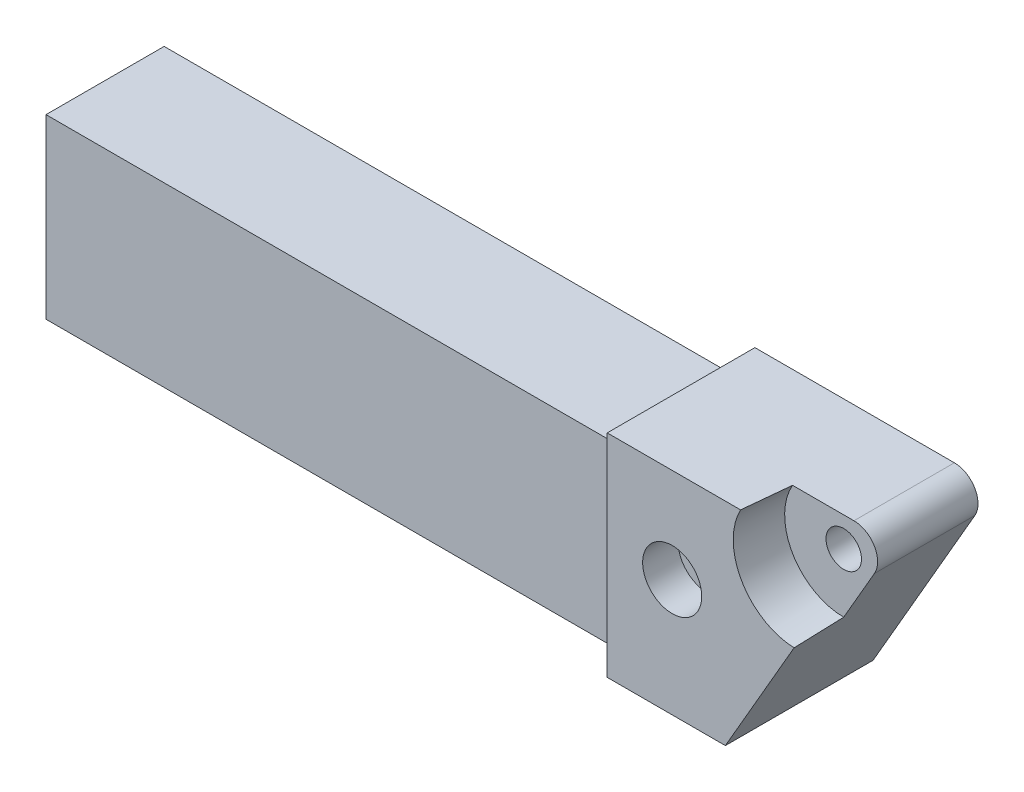
ISO-10303-21;
HEADER;
FILE_DESCRIPTION(('STEP AP214'),'2;1');
FILE_NAME('part.step','',(''),(''),'','','');
FILE_SCHEMA(('AUTOMOTIVE_DESIGN { 1 0 10303 214 1 1 1 1 }'));
ENDSEC;
DATA;
#1=APPLICATION_CONTEXT('core data for automotive mechanical design processes');
#2=APPLICATION_PROTOCOL_DEFINITION('international standard','automotive_design',2000,#1);
#3=PRODUCT_CONTEXT('',#1,'mechanical');
#4=PRODUCT('Part','Part','',(#3));
#5=PRODUCT_RELATED_PRODUCT_CATEGORY('part','',(#4));
#6=PRODUCT_DEFINITION_FORMATION('','',#4);
#7=PRODUCT_DEFINITION_CONTEXT('part definition',#1,'design');
#8=PRODUCT_DEFINITION('design','',#6,#7);
#9=PRODUCT_DEFINITION_SHAPE('','',#8);
#10=(LENGTH_UNIT() NAMED_UNIT(*) SI_UNIT(.MILLI.,.METRE.));
#11=(NAMED_UNIT(*) PLANE_ANGLE_UNIT() SI_UNIT($,.RADIAN.));
#12=(NAMED_UNIT(*) SI_UNIT($,.STERADIAN.) SOLID_ANGLE_UNIT());
#13=UNCERTAINTY_MEASURE_WITH_UNIT(LENGTH_MEASURE(1.E-05),#10,'distance_accuracy_value','');
#14=(GEOMETRIC_REPRESENTATION_CONTEXT(3) GLOBAL_UNCERTAINTY_ASSIGNED_CONTEXT((#13)) GLOBAL_UNIT_ASSIGNED_CONTEXT((#10,
#11,#12)) REPRESENTATION_CONTEXT('',''));
#15=CARTESIAN_POINT('',(0.,0.,0.));
#16=DIRECTION('',(0.,0.,1.));
#17=DIRECTION('',(1.,0.,0.));
#18=AXIS2_PLACEMENT_3D('',#15,#16,#17);
#19=CARTESIAN_POINT('',(-50.,15.,20.));
#20=DIRECTION('',(0.,-1.,0.));
#21=DIRECTION('',(0.,0.,-1.));
#22=AXIS2_PLACEMENT_3D('',#19,#20,#21);
#23=PLANE('',#22);
#24=DIRECTION('',(-1.,0.,0.));
#25=VECTOR('',#24,1.);
#26=CARTESIAN_POINT('',(-50.,15.,20.));
#27=LINE('',#26,#25);
#28=CARTESIAN_POINT('',(45.,15.,20.));
#29=VERTEX_POINT('',#28);
#30=CARTESIAN_POINT('',(-50.,15.,20.));
#31=VERTEX_POINT('',#30);
#32=EDGE_CURVE('E247',#29,#31,#27,.T.);
#33=ORIENTED_EDGE('',*,*,#32,.F.);
#34=DIRECTION('',(0.,0.,-1.));
#35=VECTOR('',#34,1.);
#36=CARTESIAN_POINT('',(45.,15.,20.));
#37=LINE('',#36,#35);
#38=CARTESIAN_POINT('',(45.,15.,0.));
#39=VERTEX_POINT('',#38);
#40=EDGE_CURVE('E263',#29,#39,#37,.T.);
#41=ORIENTED_EDGE('',*,*,#40,.T.);
#42=DIRECTION('',(-1.,0.,0.));
#43=VECTOR('',#42,1.);
#44=CARTESIAN_POINT('',(-50.,15.,0.));
#45=LINE('',#44,#43);
#46=CARTESIAN_POINT('',(-50.,15.,0.));
#47=VERTEX_POINT('',#46);
#48=EDGE_CURVE('E255',#39,#47,#45,.T.);
#49=ORIENTED_EDGE('',*,*,#48,.T.);
#50=DIRECTION('',(0.,0.,-1.));
#51=VECTOR('',#50,1.);
#52=CARTESIAN_POINT('',(-50.,15.,20.));
#53=LINE('',#52,#51);
#54=EDGE_CURVE('E260',#31,#47,#53,.T.);
#55=ORIENTED_EDGE('',*,*,#54,.F.);
#56=EDGE_LOOP('',(#33,#41,#49,#55));
#57=FACE_BOUND('',#56,.T.);
#58=ADVANCED_FACE('F36',(#57),#23,.F.);
#59=CARTESIAN_POINT('',(-50.,15.,20.));
#60=DIRECTION('',(1.,0.,0.));
#61=DIRECTION('',(0.,1.,0.));
#62=AXIS2_PLACEMENT_3D('',#59,#60,#61);
#63=PLANE('',#62);
#64=DIRECTION('',(0.,-1.,0.));
#65=VECTOR('',#64,1.);
#66=CARTESIAN_POINT('',(-50.,15.,0.));
#67=LINE('',#66,#65);
#68=CARTESIAN_POINT('',(-50.,-15.,0.));
#69=VERTEX_POINT('',#68);
#70=EDGE_CURVE('E253',#47,#69,#67,.T.);
#71=ORIENTED_EDGE('',*,*,#70,.T.);
#72=DIRECTION('',(0.,0.,-1.));
#73=VECTOR('',#72,1.);
#74=CARTESIAN_POINT('',(-50.,-15.,20.));
#75=LINE('',#74,#73);
#76=CARTESIAN_POINT('',(-50.,-15.,20.));
#77=VERTEX_POINT('',#76);
#78=EDGE_CURVE('E257',#77,#69,#75,.T.);
#79=ORIENTED_EDGE('',*,*,#78,.F.);
#80=DIRECTION('',(0.,-1.,0.));
#81=VECTOR('',#80,1.);
#82=CARTESIAN_POINT('',(-50.,15.,20.));
#83=LINE('',#82,#81);
#84=EDGE_CURVE('E249',#31,#77,#83,.T.);
#85=ORIENTED_EDGE('',*,*,#84,.F.);
#86=ORIENTED_EDGE('',*,*,#54,.T.);
#87=EDGE_LOOP('',(#71,#79,#85,#86));
#88=FACE_BOUND('',#87,.T.);
#89=ADVANCED_FACE('F167',(#88),#63,.F.);
#90=CARTESIAN_POINT('',(-50.,-15.,20.));
#91=DIRECTION('',(0.,1.,0.));
#92=DIRECTION('',(0.,0.,1.));
#93=AXIS2_PLACEMENT_3D('',#90,#91,#92);
#94=PLANE('',#93);
#95=DIRECTION('',(1.,0.,0.));
#96=VECTOR('',#95,1.);
#97=CARTESIAN_POINT('',(-50.,-15.,0.));
#98=LINE('',#97,#96);
#99=CARTESIAN_POINT('',(70.,-15.,0.));
#100=VERTEX_POINT('',#99);
#101=EDGE_CURVE('E250',#69,#100,#98,.T.);
#102=ORIENTED_EDGE('',*,*,#101,.T.);
#103=DIRECTION('',(0.,0.,1.));
#104=VECTOR('',#103,1.);
#105=CARTESIAN_POINT('',(70.,-15.,0.));
#106=LINE('',#105,#104);
#107=CARTESIAN_POINT('',(70.,-15.,25.));
#108=VERTEX_POINT('',#107);
#109=EDGE_CURVE('E204',#100,#108,#106,.T.);
#110=ORIENTED_EDGE('',*,*,#109,.T.);
#111=DIRECTION('',(1.,0.,0.));
#112=VECTOR('',#111,1.);
#113=CARTESIAN_POINT('',(50.,-15.,25.));
#114=LINE('',#113,#112);
#115=CARTESIAN_POINT('',(50.,-15.,25.));
#116=VERTEX_POINT('',#115);
#117=EDGE_CURVE('E232',#116,#108,#114,.T.);
#118=ORIENTED_EDGE('',*,*,#117,.F.);
#119=CARTESIAN_POINT('',(45.,-15.,25.));
#120=DIRECTION('',(0.,1.,0.));
#121=DIRECTION('',(0.,0.,1.));
#122=AXIS2_PLACEMENT_3D('',#119,#120,#121);
#123=CIRCLE('',#122,5.);
#124=CARTESIAN_POINT('',(45.,-15.,20.));
#125=VERTEX_POINT('',#124);
#126=EDGE_CURVE('E217',#116,#125,#123,.T.);
#127=ORIENTED_EDGE('',*,*,#126,.T.);
#128=DIRECTION('',(1.,0.,0.));
#129=VECTOR('',#128,1.);
#130=CARTESIAN_POINT('',(-50.,-15.,20.));
#131=LINE('',#130,#129);
#132=EDGE_CURVE('E252',#77,#125,#131,.T.);
#133=ORIENTED_EDGE('',*,*,#132,.F.);
#134=ORIENTED_EDGE('',*,*,#78,.T.);
#135=EDGE_LOOP('',(#102,#110,#118,#127,#133,#134));
#136=FACE_BOUND('',#135,.T.);
#137=ADVANCED_FACE('F171',(#136),#94,.F.);
#138=CARTESIAN_POINT('',(0.,0.,20.));
#139=DIRECTION('',(0.,0.,1.));
#140=DIRECTION('',(1.,0.,0.));
#141=AXIS2_PLACEMENT_3D('',#138,#139,#140);
#142=PLANE('',#141);
#143=ORIENTED_EDGE('',*,*,#132,.T.);
#144=DIRECTION('',(0.,1.,0.));
#145=VECTOR('',#144,1.);
#146=CARTESIAN_POINT('',(45.,15.,20.));
#147=LINE('',#146,#145);
#148=EDGE_CURVE('E224',#125,#29,#147,.T.);
#149=ORIENTED_EDGE('',*,*,#148,.T.);
#150=ORIENTED_EDGE('',*,*,#32,.T.);
#151=ORIENTED_EDGE('',*,*,#84,.T.);
#152=EDGE_LOOP('',(#143,#149,#150,#151));
#153=FACE_BOUND('',#152,.T.);
#154=ADVANCED_FACE('F175',(#153),#142,.T.);
#155=CARTESIAN_POINT('',(0.,0.,0.));
#156=DIRECTION('',(0.,0.,1.));
#157=DIRECTION('',(1.,0.,0.));
#158=AXIS2_PLACEMENT_3D('',#155,#156,#157);
#159=PLANE('',#158);
#160=CARTESIAN_POINT('',(61.,4.84504138230249,0.));
#161=DIRECTION('',(0.,0.,1.));
#162=DIRECTION('',(1.,0.,0.));
#163=AXIS2_PLACEMENT_3D('',#160,#161,#162);
#164=CIRCLE('',#163,2.50000000000002);
#165=CARTESIAN_POINT('',(63.5,4.84504138230249,0.));
#166=VERTEX_POINT('',#165);
#167=EDGE_CURVE('E292',#166,#166,#164,.T.);
#168=ORIENTED_EDGE('',*,*,#167,.T.);
#169=EDGE_LOOP('',(#168));
#170=FACE_BOUND('',#169,.T.);
#171=CARTESIAN_POINT('',(82.0348902533414,15.8450413823025,0.));
#172=DIRECTION('',(0.,0.,1.));
#173=DIRECTION('',(1.,0.,0.));
#174=AXIS2_PLACEMENT_3D('',#171,#172,#173);
#175=CIRCLE('',#174,3.00000000000001);
#176=CARTESIAN_POINT('',(85.0348902533414,15.8450413823025,0.));
#177=VERTEX_POINT('',#176);
#178=EDGE_CURVE('E129',#177,#177,#175,.T.);
#179=ORIENTED_EDGE('',*,*,#178,.T.);
#180=EDGE_LOOP('',(#179));
#181=FACE_BOUND('',#180,.T.);
#182=DIRECTION('',(-1.,0.,0.));
#183=VECTOR('',#182,1.);
#184=CARTESIAN_POINT('',(90.6951442911858,20.8450413823025,0.));
#185=LINE('',#184,#183);
#186=CARTESIAN_POINT('',(83.7669410609103,20.8450413823025,0.));
#187=VERTEX_POINT('',#186);
#188=CARTESIAN_POINT('',(50.,20.8450413823025,0.));
#189=VERTEX_POINT('',#188);
#190=EDGE_CURVE('E207',#187,#189,#185,.T.);
#191=ORIENTED_EDGE('',*,*,#190,.F.);
#192=CARTESIAN_POINT('',(83.7669410609103,16.8450413823025,0.));
#193=DIRECTION('',(0.,0.,1.));
#194=DIRECTION('',(1.,0.,0.));
#195=AXIS2_PLACEMENT_3D('',#192,#193,#194);
#196=CIRCLE('',#195,4.);
#197=CARTESIAN_POINT('',(87.231042676048,14.8450413823025,0.));
#198=VERTEX_POINT('',#197);
#199=EDGE_CURVE('E11',#187,#198,#196,.F.);
#200=ORIENTED_EDGE('',*,*,#199,.T.);
#201=DIRECTION('',(0.500000000000004,0.866025403784436,0.));
#202=VECTOR('',#201,1.);
#203=CARTESIAN_POINT('',(70.,-15.,0.));
#204=LINE('',#203,#202);
#205=EDGE_CURVE('E200',#100,#198,#204,.T.);
#206=ORIENTED_EDGE('',*,*,#205,.F.);
#207=ORIENTED_EDGE('',*,*,#101,.F.);
#208=ORIENTED_EDGE('',*,*,#70,.F.);
#209=ORIENTED_EDGE('',*,*,#48,.F.);
#210=CARTESIAN_POINT('',(45.,20.,0.));
#211=DIRECTION('',(0.,0.,1.));
#212=DIRECTION('',(1.,0.,0.));
#213=AXIS2_PLACEMENT_3D('',#210,#211,#212);
#214=CIRCLE('',#213,5.);
#215=CARTESIAN_POINT('',(50.,20.,0.));
#216=VERTEX_POINT('',#215);
#217=EDGE_CURVE('E218',#39,#216,#214,.T.);
#218=ORIENTED_EDGE('',*,*,#217,.T.);
#219=DIRECTION('',(0.,-1.,0.));
#220=VECTOR('',#219,1.);
#221=CARTESIAN_POINT('',(50.,20.8450413823025,0.));
#222=LINE('',#221,#220);
#223=EDGE_CURVE('E208',#189,#216,#222,.T.);
#224=ORIENTED_EDGE('',*,*,#223,.F.);
#225=EDGE_LOOP('',(#191,#200,#206,#207,#208,#209,#218,#224));
#226=FACE_BOUND('',#225,.T.);
#227=ADVANCED_FACE('F177',(#170,#181,#226),#159,.F.);
#228=CARTESIAN_POINT('',(50.,20.8450413823025,0.));
#229=DIRECTION('',(-1.,0.,0.));
#230=DIRECTION('',(0.,0.,1.));
#231=AXIS2_PLACEMENT_3D('',#228,#229,#230);
#232=PLANE('',#231);
#233=ORIENTED_EDGE('',*,*,#223,.T.);
#234=DIRECTION('',(0.,0.,-1.));
#235=VECTOR('',#234,1.);
#236=CARTESIAN_POINT('',(50.,20.,0.));
#237=LINE('',#236,#235);
#238=CARTESIAN_POINT('',(50.,20.,25.));
#239=VERTEX_POINT('',#238);
#240=EDGE_CURVE('E273',#216,#239,#237,.F.);
#241=ORIENTED_EDGE('',*,*,#240,.T.);
#242=DIRECTION('',(0.,-1.,0.));
#243=VECTOR('',#242,1.);
#244=CARTESIAN_POINT('',(50.,20.8450413823025,25.));
#245=LINE('',#244,#243);
#246=CARTESIAN_POINT('',(50.,20.8450413823025,25.));
#247=VERTEX_POINT('',#246);
#248=EDGE_CURVE('E235',#247,#239,#245,.T.);
#249=ORIENTED_EDGE('',*,*,#248,.F.);
#250=DIRECTION('',(0.,0.,1.));
#251=VECTOR('',#250,1.);
#252=CARTESIAN_POINT('',(50.,20.8450413823025,0.));
#253=LINE('',#252,#251);
#254=EDGE_CURVE('E270',#189,#247,#253,.T.);
#255=ORIENTED_EDGE('',*,*,#254,.F.);
#256=EDGE_LOOP('',(#233,#241,#249,#255));
#257=FACE_BOUND('',#256,.T.);
#258=ADVANCED_FACE('F180',(#257),#232,.T.);
#259=CARTESIAN_POINT('',(90.6951442911858,20.8450413823025,0.));
#260=DIRECTION('',(0.,1.,0.));
#261=DIRECTION('',(-1.,0.,0.));
#262=AXIS2_PLACEMENT_3D('',#259,#260,#261);
#263=PLANE('',#262);
#264=DIRECTION('',(1.,0.,0.));
#265=VECTOR('',#264,1.);
#266=CARTESIAN_POINT('',(90.6951442911858,20.8450413823025,17.));
#267=LINE('',#266,#265);
#268=CARTESIAN_POINT('',(73.3746362154971,20.8450413823025,17.));
#269=VERTEX_POINT('',#268);
#270=CARTESIAN_POINT('',(83.7669410609103,20.8450413823025,17.));
#271=VERTEX_POINT('',#270);
#272=EDGE_CURVE('E115',#269,#271,#267,.T.);
#273=ORIENTED_EDGE('',*,*,#272,.T.);
#274=DIRECTION('',(0.,0.,1.));
#275=VECTOR('',#274,1.);
#276=CARTESIAN_POINT('',(83.7669410609103,20.8450413823025,0.));
#277=LINE('',#276,#275);
#278=EDGE_CURVE('E44',#271,#187,#277,.F.);
#279=ORIENTED_EDGE('',*,*,#278,.T.);
#280=ORIENTED_EDGE('',*,*,#190,.T.);
#281=ORIENTED_EDGE('',*,*,#254,.T.);
#282=DIRECTION('',(-1.,0.,0.));
#283=VECTOR('',#282,1.);
#284=CARTESIAN_POINT('',(90.6951442911858,20.8450413823025,25.));
#285=LINE('',#284,#283);
#286=CARTESIAN_POINT('',(72.5750774008658,20.8450413823025,25.));
#287=VERTEX_POINT('',#286);
#288=EDGE_CURVE('E134',#287,#247,#285,.T.);
#289=ORIENTED_EDGE('',*,*,#288,.F.);
#290=CARTESIAN_POINT('',(73.3746362154971,20.8450413823025,17.));
#291=CARTESIAN_POINT('',(73.2205556846486,20.8450413823025,18.5252956211243));
#292=CARTESIAN_POINT('',(73.0674733243553,20.8450413823025,20.0506917554421));
#293=CARTESIAN_POINT('',(72.7630573666214,20.8450413823025,23.1016570178582));
#294=CARTESIAN_POINT('',(72.6117237674327,20.8450413823025,24.627226145782));
#295=CARTESIAN_POINT('',(72.3105574794071,20.8450413823025,27.6785120799178));
#296=CARTESIAN_POINT('',(72.1607247902429,20.8450413823025,29.2042288860975));
#297=CARTESIAN_POINT('',(71.8623765659033,20.8450413823025,32.2557928396095));
#298=CARTESIAN_POINT('',(71.7138610320428,20.8450413823025,33.7816399870703));
#299=CARTESIAN_POINT('',(71.5659123636992,20.8450413823025,35.307541947163));
#300=B_SPLINE_CURVE_WITH_KNOTS('',3,(#290,#291,#292,#293,#294,#295,#296,#297,#298,#299),
.UNSPECIFIED.,.F.,.F.,(4,2,2,2,4),(0.,4.5991739108353,9.19834322375983,13.7975115335998,
18.396684434636),.UNSPECIFIED.);
#301=EDGE_CURVE('E121',#269,#287,#300,.T.);
#302=ORIENTED_EDGE('',*,*,#301,.F.);
#303=EDGE_LOOP('',(#273,#279,#280,#281,#289,#302));
#304=FACE_BOUND('',#303,.T.);
#305=ADVANCED_FACE('F132',(#304),#263,.T.);
#306=CARTESIAN_POINT('',(70.,-15.,0.));
#307=DIRECTION('',(0.866025403784436,-0.500000000000004,0.));
#308=DIRECTION('',(0.500000000000004,0.866025403784437,0.));
#309=AXIS2_PLACEMENT_3D('',#306,#307,#308);
#310=PLANE('',#309);
#311=ORIENTED_EDGE('',*,*,#205,.T.);
#312=DIRECTION('',(0.,0.,1.));
#313=VECTOR('',#312,1.);
#314=CARTESIAN_POINT('',(87.231042676048,14.8450413823025,0.));
#315=LINE('',#314,#313);
#316=CARTESIAN_POINT('',(87.231042676048,14.8450413823025,17.));
#317=VERTEX_POINT('',#316);
#318=EDGE_CURVE('E202',#198,#317,#315,.T.);
#319=ORIENTED_EDGE('',*,*,#318,.T.);
#320=DIRECTION('',(-0.500000000000004,-0.866025403784437,0.));
#321=VECTOR('',#320,1.);
#322=CARTESIAN_POINT('',(70.,-15.,17.));
#323=LINE('',#322,#321);
#324=CARTESIAN_POINT('',(82.0348902533413,5.8450413823025,17.));
#325=VERTEX_POINT('',#324);
#326=EDGE_CURVE('E212',#317,#325,#323,.T.);
#327=ORIENTED_EDGE('',*,*,#326,.T.);
#328=CARTESIAN_POINT('',(80.2114300170842,2.68671560752352,54.5371041974489));
#329=CARTESIAN_POINT('',(80.2852990569576,2.81466053769065,52.9726505439011));
#330=CARTESIAN_POINT('',(80.3593530022565,2.94292573344932,51.408231805601));
#331=CARTESIAN_POINT('',(80.5078785318212,3.20017949687644,48.2794734881091));
#332=CARTESIAN_POINT('',(80.5823501161274,3.32916806461481,46.715133908925));
#333=CARTESIAN_POINT('',(80.8064626597205,3.71734237673168,42.0222564929249));
#334=CARTESIAN_POINT('',(80.9568017933977,3.97773739462647,38.8938518404164));
#335=CARTESIAN_POINT('',(81.2598540890713,4.50263936808348,32.6374983976965));
#336=CARTESIAN_POINT('',(81.4125672535119,4.76714632787923,29.5095496079577));
#337=CARTESIAN_POINT('',(81.6439795759656,5.16796422786652,24.818084591633));
#338=CARTESIAN_POINT('',(81.7215075454927,5.30224661009516,23.2543373059183));
#339=CARTESIAN_POINT('',(81.8774787986248,5.57239674504016,20.1270248040092));
#340=CARTESIAN_POINT('',(81.9559220825686,5.70826449834342,18.5634595878825));
#341=CARTESIAN_POINT('',(82.0348902533413,5.84504138230251,17.));
#342=B_SPLINE_CURVE_WITH_KNOTS('',3,(#328,#329,#330,#331,#332,#333,#334,#335,#336,#337,#338,
#339,#340,#341),.UNSPECIFIED.,.F.,.F.,(4,2,2,2,2,2,4),(0.,4.71424176629178,9.42848398824529,
18.8569439121076,28.285413543874,32.9996602695487,37.7139087404478),.UNSPECIFIED.);
#343=CARTESIAN_POINT('',(81.6351108460257,5.15260313701207,25.));
#344=VERTEX_POINT('',#343);
#345=EDGE_CURVE('E128',#344,#325,#342,.T.);
#346=ORIENTED_EDGE('',*,*,#345,.F.);
#347=DIRECTION('',(0.500000000000004,0.866025403784436,0.));
#348=VECTOR('',#347,1.);
#349=CARTESIAN_POINT('',(70.,-15.,25.));
#350=LINE('',#349,#348);
#351=EDGE_CURVE('E230',#108,#344,#350,.T.);
#352=ORIENTED_EDGE('',*,*,#351,.F.);
#353=ORIENTED_EDGE('',*,*,#109,.F.);
#354=EDGE_LOOP('',(#311,#319,#327,#346,#352,#353));
#355=FACE_BOUND('',#354,.T.);
#356=ADVANCED_FACE('F187',(#355),#310,.T.);
#357=CARTESIAN_POINT('',(0.,0.,25.));
#358=DIRECTION('',(0.,0.,1.));
#359=DIRECTION('',(1.,0.,0.));
#360=AXIS2_PLACEMENT_3D('',#357,#358,#359);
#361=PLANE('',#360);
#362=CARTESIAN_POINT('',(61.,4.84504138230249,25.));
#363=DIRECTION('',(0.,0.,1.));
#364=DIRECTION('',(1.,0.,0.));
#365=AXIS2_PLACEMENT_3D('',#362,#363,#364);
#366=CIRCLE('',#365,5.00000000000002);
#367=CARTESIAN_POINT('',(66.,4.84504138230249,25.));
#368=VERTEX_POINT('',#367);
#369=EDGE_CURVE('E303',#368,#368,#366,.T.);
#370=ORIENTED_EDGE('',*,*,#369,.F.);
#371=EDGE_LOOP('',(#370));
#372=FACE_BOUND('',#371,.T.);
#373=CARTESIAN_POINT('',(82.0348902533414,15.8450413823025,25.));
#374=DIRECTION('',(0.,0.,1.));
#375=DIRECTION('',(1.,0.,0.));
#376=AXIS2_PLACEMENT_3D('',#373,#374,#375);
#377=CIRCLE('',#376,10.6999093082074);
#378=EDGE_CURVE('E215',#287,#344,#377,.T.);
#379=ORIENTED_EDGE('',*,*,#378,.F.);
#380=ORIENTED_EDGE('',*,*,#288,.T.);
#381=ORIENTED_EDGE('',*,*,#248,.T.);
#382=EDGE_CURVE('E229',#239,#116,#245,.T.);
#383=ORIENTED_EDGE('',*,*,#382,.T.);
#384=ORIENTED_EDGE('',*,*,#117,.T.);
#385=ORIENTED_EDGE('',*,*,#351,.T.);
#386=EDGE_LOOP('',(#379,#380,#381,#383,#384,#385));
#387=FACE_BOUND('',#386,.T.);
#388=ADVANCED_FACE('F160',(#372,#387),#361,.T.);
#389=CARTESIAN_POINT('',(45.,0.,25.));
#390=DIRECTION('',(0.,-1.,0.));
#391=DIRECTION('',(0.,0.,-1.));
#392=AXIS2_PLACEMENT_3D('',#389,#390,#391);
#393=CYLINDRICAL_SURFACE('',#392,5.);
#394=ORIENTED_EDGE('',*,*,#126,.F.);
#395=ORIENTED_EDGE('',*,*,#382,.F.);
#396=CARTESIAN_POINT('',(45.,20.,25.));
#397=DIRECTION('',(0.,-0.707106781186547,0.707106781186547));
#398=DIRECTION('',(0.,-0.707106781186547,-0.707106781186547));
#399=AXIS2_PLACEMENT_3D('',#396,#397,#398);
#400=ELLIPSE('',#399,7.07106781186547,5.);
#401=EDGE_CURVE('E120',#29,#239,#400,.T.);
#402=ORIENTED_EDGE('',*,*,#401,.F.);
#403=ORIENTED_EDGE('',*,*,#148,.F.);
#404=EDGE_LOOP('',(#394,#395,#402,#403));
#405=FACE_BOUND('',#404,.T.);
#406=ADVANCED_FACE('F156',(#405),#393,.F.);
#407=CARTESIAN_POINT('',(45.,20.,20.));
#408=DIRECTION('',(0.,0.,-1.));
#409=DIRECTION('',(-1.,0.,0.));
#410=AXIS2_PLACEMENT_3D('',#407,#408,#409);
#411=CYLINDRICAL_SURFACE('',#410,5.);
#412=ORIENTED_EDGE('',*,*,#401,.T.);
#413=ORIENTED_EDGE('',*,*,#240,.F.);
#414=ORIENTED_EDGE('',*,*,#217,.F.);
#415=ORIENTED_EDGE('',*,*,#40,.F.);
#416=EDGE_LOOP('',(#412,#413,#414,#415));
#417=FACE_BOUND('',#416,.T.);
#418=ADVANCED_FACE('F155',(#417),#411,.F.);
#419=CARTESIAN_POINT('',(82.0348902533414,15.8450413823025,17.));
#420=DIRECTION('',(0.,0.,1.));
#421=DIRECTION('',(1.,0.,0.));
#422=AXIS2_PLACEMENT_3D('',#419,#420,#421);
#423=CONICAL_SURFACE('',#422,9.99999999999999,0.0872664625997167);
#424=ORIENTED_EDGE('',*,*,#301,.T.);
#425=ORIENTED_EDGE('',*,*,#378,.T.);
#426=ORIENTED_EDGE('',*,*,#345,.T.);
#427=CARTESIAN_POINT('',(82.0348902533414,15.8450413823025,17.));
#428=DIRECTION('',(0.,0.,1.));
#429=DIRECTION('',(1.,0.,0.));
#430=AXIS2_PLACEMENT_3D('',#427,#428,#429);
#431=CIRCLE('',#430,9.99999999999999);
#432=EDGE_CURVE('E118',#269,#325,#431,.T.);
#433=ORIENTED_EDGE('',*,*,#432,.F.);
#434=EDGE_LOOP('',(#424,#425,#426,#433));
#435=FACE_BOUND('',#434,.T.);
#436=ADVANCED_FACE('F125',(#435),#423,.F.);
#437=CARTESIAN_POINT('',(82.0348902533414,15.8450413823025,17.));
#438=DIRECTION('',(0.,0.,1.));
#439=DIRECTION('',(1.,0.,0.));
#440=AXIS2_PLACEMENT_3D('',#437,#438,#439);
#441=PLANE('',#440);
#442=CARTESIAN_POINT('',(82.0348902533414,15.8450413823025,17.));
#443=DIRECTION('',(0.,0.,1.));
#444=DIRECTION('',(1.,0.,0.));
#445=AXIS2_PLACEMENT_3D('',#442,#443,#444);
#446=CIRCLE('',#445,3.00000000000001);
#447=CARTESIAN_POINT('',(85.0348902533414,15.8450413823025,17.));
#448=VERTEX_POINT('',#447);
#449=EDGE_CURVE('E289',#448,#448,#446,.T.);
#450=ORIENTED_EDGE('',*,*,#449,.F.);
#451=EDGE_LOOP('',(#450));
#452=FACE_BOUND('',#451,.T.);
#453=ORIENTED_EDGE('',*,*,#326,.F.);
#454=CARTESIAN_POINT('',(83.7669410609103,16.8450413823025,17.));
#455=DIRECTION('',(0.,0.,1.));
#456=DIRECTION('',(1.,0.,0.));
#457=AXIS2_PLACEMENT_3D('',#454,#455,#456);
#458=CIRCLE('',#457,4.);
#459=EDGE_CURVE('E58',#317,#271,#458,.T.);
#460=ORIENTED_EDGE('',*,*,#459,.T.);
#461=ORIENTED_EDGE('',*,*,#272,.F.);
#462=ORIENTED_EDGE('',*,*,#432,.T.);
#463=EDGE_LOOP('',(#453,#460,#461,#462));
#464=FACE_BOUND('',#463,.T.);
#465=ADVANCED_FACE('F117',(#452,#464),#441,.T.);
#466=CARTESIAN_POINT('',(82.0348902533414,15.8450413823025,0.));
#467=DIRECTION('',(0.,0.,1.));
#468=DIRECTION('',(1.,0.,0.));
#469=AXIS2_PLACEMENT_3D('',#466,#467,#468);
#470=CYLINDRICAL_SURFACE('',#469,3.00000000000001);
#471=ORIENTED_EDGE('',*,*,#178,.F.);
#472=EDGE_LOOP('',(#471));
#473=FACE_BOUND('',#472,.T.);
#474=ORIENTED_EDGE('',*,*,#449,.T.);
#475=EDGE_LOOP('',(#474));
#476=FACE_BOUND('',#475,.T.);
#477=ADVANCED_FACE('F323',(#473,#476),#470,.F.);
#478=CARTESIAN_POINT('',(61.,4.84504138230249,25.));
#479=DIRECTION('',(0.,0.,1.));
#480=DIRECTION('',(1.,0.,0.));
#481=AXIS2_PLACEMENT_3D('',#478,#479,#480);
#482=CYLINDRICAL_SURFACE('',#481,2.50000000000002);
#483=ORIENTED_EDGE('',*,*,#167,.F.);
#484=EDGE_LOOP('',(#483));
#485=FACE_BOUND('',#484,.T.);
#486=CARTESIAN_POINT('',(61.,4.84504138230249,19.));
#487=DIRECTION('',(0.,0.,1.));
#488=DIRECTION('',(1.,0.,0.));
#489=AXIS2_PLACEMENT_3D('',#486,#487,#488);
#490=CIRCLE('',#489,2.50000000000002);
#491=CARTESIAN_POINT('',(63.5,4.84504138230249,19.));
#492=VERTEX_POINT('',#491);
#493=EDGE_CURVE('E297',#492,#492,#490,.T.);
#494=ORIENTED_EDGE('',*,*,#493,.T.);
#495=EDGE_LOOP('',(#494));
#496=FACE_BOUND('',#495,.T.);
#497=ADVANCED_FACE('F316',(#485,#496),#482,.F.);
#498=CARTESIAN_POINT('',(63.5,4.84504138230249,19.));
#499=DIRECTION('',(0.,0.,-1.));
#500=DIRECTION('',(-1.,0.,0.));
#501=AXIS2_PLACEMENT_3D('',#498,#499,#500);
#502=PLANE('',#501);
#503=ORIENTED_EDGE('',*,*,#493,.F.);
#504=EDGE_LOOP('',(#503));
#505=FACE_BOUND('',#504,.T.);
#506=CARTESIAN_POINT('',(61.,4.84504138230249,19.));
#507=DIRECTION('',(0.,0.,1.));
#508=DIRECTION('',(1.,0.,0.));
#509=AXIS2_PLACEMENT_3D('',#506,#507,#508);
#510=CIRCLE('',#509,5.00000000000002);
#511=CARTESIAN_POINT('',(66.,4.84504138230249,19.));
#512=VERTEX_POINT('',#511);
#513=EDGE_CURVE('E300',#512,#512,#510,.T.);
#514=ORIENTED_EDGE('',*,*,#513,.T.);
#515=EDGE_LOOP('',(#514));
#516=FACE_BOUND('',#515,.T.);
#517=ADVANCED_FACE('F309',(#505,#516),#502,.F.);
#518=CARTESIAN_POINT('',(61.,4.84504138230249,25.));
#519=DIRECTION('',(0.,0.,1.));
#520=DIRECTION('',(1.,0.,0.));
#521=AXIS2_PLACEMENT_3D('',#518,#519,#520);
#522=CYLINDRICAL_SURFACE('',#521,5.00000000000002);
#523=ORIENTED_EDGE('',*,*,#513,.F.);
#524=EDGE_LOOP('',(#523));
#525=FACE_BOUND('',#524,.T.);
#526=ORIENTED_EDGE('',*,*,#369,.T.);
#527=EDGE_LOOP('',(#526));
#528=FACE_BOUND('',#527,.T.);
#529=ADVANCED_FACE('F307',(#525,#528),#522,.F.);
#530=CARTESIAN_POINT('',(83.7669410609103,16.8450413823025,0.));
#531=DIRECTION('',(0.,0.,1.));
#532=DIRECTION('',(1.,0.,0.));
#533=AXIS2_PLACEMENT_3D('',#530,#531,#532);
#534=CYLINDRICAL_SURFACE('',#533,4.);
#535=ORIENTED_EDGE('',*,*,#199,.F.);
#536=ORIENTED_EDGE('',*,*,#278,.F.);
#537=ORIENTED_EDGE('',*,*,#459,.F.);
#538=ORIENTED_EDGE('',*,*,#318,.F.);
#539=EDGE_LOOP('',(#535,#536,#537,#538));
#540=FACE_BOUND('',#539,.T.);
#541=ADVANCED_FACE('F38',(#540),#534,.T.);
#542=CLOSED_SHELL('',(#58,#89,#137,#154,#227,#258,#305,#356,#388,#406,#418,#436,#465,#477,#497,
#517,#529,#541));
#543=MANIFOLD_SOLID_BREP('B2',#542);
#544=ADVANCED_BREP_SHAPE_REPRESENTATION('',(#18,#543),#14);
#545=SHAPE_DEFINITION_REPRESENTATION(#9,#544);
ENDSEC;
END-ISO-10303-21;
